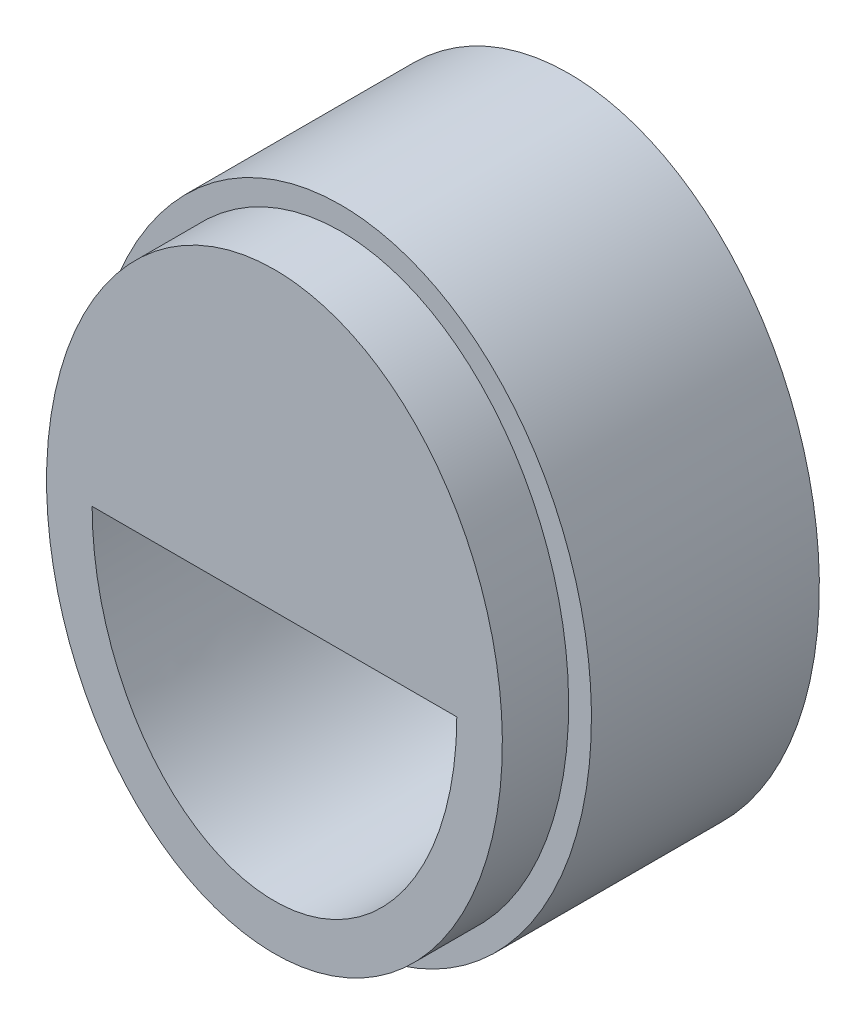
ISO-10303-21;
HEADER;
FILE_DESCRIPTION(('STEP AP214'),'2;1');
FILE_NAME('part.step','',(''),(''),'','','');
FILE_SCHEMA(('AUTOMOTIVE_DESIGN { 1 0 10303 214 1 1 1 1 }'));
ENDSEC;
DATA;
#1=APPLICATION_CONTEXT('core data for automotive mechanical design processes');
#2=APPLICATION_PROTOCOL_DEFINITION('international standard','automotive_design',2000,#1);
#3=PRODUCT_CONTEXT('',#1,'mechanical');
#4=PRODUCT('Part','Part','',(#3));
#5=PRODUCT_RELATED_PRODUCT_CATEGORY('part','',(#4));
#6=PRODUCT_DEFINITION_FORMATION('','',#4);
#7=PRODUCT_DEFINITION_CONTEXT('part definition',#1,'design');
#8=PRODUCT_DEFINITION('design','',#6,#7);
#9=PRODUCT_DEFINITION_SHAPE('','',#8);
#10=(LENGTH_UNIT() NAMED_UNIT(*) SI_UNIT(.MILLI.,.METRE.));
#11=(NAMED_UNIT(*) PLANE_ANGLE_UNIT() SI_UNIT($,.RADIAN.));
#12=(NAMED_UNIT(*) SI_UNIT($,.STERADIAN.) SOLID_ANGLE_UNIT());
#13=UNCERTAINTY_MEASURE_WITH_UNIT(LENGTH_MEASURE(1.E-05),#10,'distance_accuracy_value','');
#14=(GEOMETRIC_REPRESENTATION_CONTEXT(3) GLOBAL_UNCERTAINTY_ASSIGNED_CONTEXT((#13)) GLOBAL_UNIT_ASSIGNED_CONTEXT((#10,
#11,#12)) REPRESENTATION_CONTEXT('',''));
#15=CARTESIAN_POINT('',(0.,0.,0.));
#16=DIRECTION('',(0.,0.,1.));
#17=DIRECTION('',(1.,0.,0.));
#18=AXIS2_PLACEMENT_3D('',#15,#16,#17);
#19=CARTESIAN_POINT('',(0.,0.,10.));
#20=DIRECTION('',(0.,0.,1.));
#21=DIRECTION('',(0.,1.,0.));
#22=AXIS2_PLACEMENT_3D('',#19,#20,#21);
#23=ELLIPSE('',#22,12.,9.);
#24=DIRECTION('',(0.,0.,-1.));
#25=VECTOR('',#24,1.);
#26=SURFACE_OF_LINEAR_EXTRUSION('',#23,#25);
#27=CARTESIAN_POINT('',(0.,0.,0.));
#28=DIRECTION('',(0.,0.,1.));
#29=DIRECTION('',(0.,1.,0.));
#30=AXIS2_PLACEMENT_3D('',#27,#28,#29);
#31=ELLIPSE('',#30,12.,9.);
#32=CARTESIAN_POINT('',(0.,12.,0.));
#33=VERTEX_POINT('',#32);
#34=EDGE_CURVE('E120',#33,#33,#31,.T.);
#35=ORIENTED_EDGE('',*,*,#34,.F.);
#36=EDGE_LOOP('',(#35));
#37=FACE_BOUND('',#36,.T.);
#38=CARTESIAN_POINT('',(0.,0.,2.));
#39=DIRECTION('',(0.,0.,1.));
#40=DIRECTION('',(0.,1.,0.));
#41=AXIS2_PLACEMENT_3D('',#38,#39,#40);
#42=ELLIPSE('',#41,12.,9.);
#43=CARTESIAN_POINT('',(0.,12.,2.));
#44=VERTEX_POINT('',#43);
#45=EDGE_CURVE('E98',#44,#44,#42,.T.);
#46=ORIENTED_EDGE('',*,*,#45,.T.);
#47=EDGE_LOOP('',(#46));
#48=FACE_BOUND('',#47,.T.);
#49=ADVANCED_FACE('F44',(#37,#48),#26,.T.);
#50=CARTESIAN_POINT('',(0.,0.,10.));
#51=DIRECTION('',(0.,0.,1.));
#52=DIRECTION('',(1.,0.,0.));
#53=AXIS2_PLACEMENT_3D('',#50,#51,#52);
#54=PLANE('',#53);
#55=CARTESIAN_POINT('',(0.,0.,10.));
#56=DIRECTION('',(0.,0.,1.));
#57=DIRECTION('',(0.,1.,0.));
#58=AXIS2_PLACEMENT_3D('',#55,#56,#57);
#59=ELLIPSE('',#58,13.,10.);
#60=CARTESIAN_POINT('',(0.,13.,10.));
#61=VERTEX_POINT('',#60);
#62=EDGE_CURVE('E13',#61,#61,#59,.T.);
#63=ORIENTED_EDGE('',*,*,#62,.F.);
#64=EDGE_LOOP('',(#63));
#65=FACE_BOUND('',#64,.T.);
#66=CARTESIAN_POINT('',(0.,0.,10.));
#67=DIRECTION('',(0.,0.,1.));
#68=DIRECTION('',(0.,1.,0.));
#69=AXIS2_PLACEMENT_3D('',#66,#67,#68);
#70=ELLIPSE('',#69,14.,11.);
#71=CARTESIAN_POINT('',(0.,14.,10.));
#72=VERTEX_POINT('',#71);
#73=EDGE_CURVE('E53',#72,#72,#70,.T.);
#74=ORIENTED_EDGE('',*,*,#73,.T.);
#75=EDGE_LOOP('',(#74));
#76=FACE_BOUND('',#75,.T.);
#77=ADVANCED_FACE('F116',(#65,#76),#54,.T.);
#78=CARTESIAN_POINT('',(0.,0.,0.));
#79=DIRECTION('',(0.,0.,1.));
#80=DIRECTION('',(1.,0.,0.));
#81=AXIS2_PLACEMENT_3D('',#78,#79,#80);
#82=PLANE('',#81);
#83=CARTESIAN_POINT('',(0.,0.,0.));
#84=DIRECTION('',(0.,0.,1.));
#85=DIRECTION('',(0.,1.,0.));
#86=AXIS2_PLACEMENT_3D('',#83,#84,#85);
#87=ELLIPSE('',#86,14.,11.);
#88=CARTESIAN_POINT('',(0.,14.,0.));
#89=VERTEX_POINT('',#88);
#90=EDGE_CURVE('E122',#89,#89,#87,.T.);
#91=ORIENTED_EDGE('',*,*,#90,.F.);
#92=EDGE_LOOP('',(#91));
#93=FACE_BOUND('',#92,.T.);
#94=ORIENTED_EDGE('',*,*,#34,.T.);
#95=EDGE_LOOP('',(#94));
#96=FACE_BOUND('',#95,.T.);
#97=ADVANCED_FACE('F134',(#93,#96),#82,.F.);
#98=DIRECTION('',(0.,0.,-1.));
#99=VECTOR('',#98,1.);
#100=SURFACE_OF_LINEAR_EXTRUSION('',#70,#99);
#101=ORIENTED_EDGE('',*,*,#73,.F.);
#102=EDGE_LOOP('',(#101));
#103=FACE_BOUND('',#102,.T.);
#104=ORIENTED_EDGE('',*,*,#90,.T.);
#105=EDGE_LOOP('',(#104));
#106=FACE_BOUND('',#105,.T.);
#107=ADVANCED_FACE('F46',(#103,#106),#100,.F.);
#108=CARTESIAN_POINT('',(0.,0.,2.));
#109=DIRECTION('',(0.,0.,1.));
#110=DIRECTION('',(1.,0.,0.));
#111=AXIS2_PLACEMENT_3D('',#108,#109,#110);
#112=PLANE('',#111);
#113=CARTESIAN_POINT('',(0.,0.,2.));
#114=DIRECTION('',(0.,0.,1.));
#115=DIRECTION('',(0.,1.,0.));
#116=AXIS2_PLACEMENT_3D('',#113,#114,#115);
#117=ELLIPSE('',#116,11.,8.);
#118=CARTESIAN_POINT('',(0.,11.,2.));
#119=VERTEX_POINT('',#118);
#120=EDGE_CURVE('E94',#119,#119,#117,.T.);
#121=ORIENTED_EDGE('',*,*,#120,.T.);
#122=EDGE_LOOP('',(#121));
#123=FACE_BOUND('',#122,.T.);
#124=ORIENTED_EDGE('',*,*,#45,.F.);
#125=EDGE_LOOP('',(#124));
#126=FACE_BOUND('',#125,.T.);
#127=ADVANCED_FACE('F107',(#123,#126),#112,.F.);
#128=CARTESIAN_POINT('',(0.,0.,2.));
#129=DIRECTION('',(0.,0.,1.));
#130=DIRECTION('',(0.,1.,0.));
#131=AXIS2_PLACEMENT_3D('',#128,#129,#130);
#132=ELLIPSE('',#131,13.,10.);
#133=DIRECTION('',(0.,0.,1.));
#134=VECTOR('',#133,1.);
#135=SURFACE_OF_LINEAR_EXTRUSION('',#132,#134);
#136=ORIENTED_EDGE('',*,*,#62,.T.);
#137=EDGE_LOOP('',(#136));
#138=FACE_BOUND('',#137,.T.);
#139=CARTESIAN_POINT('',(0.,0.,12.9096604602894));
#140=DIRECTION('',(0.,0.,1.));
#141=DIRECTION('',(0.,1.,0.));
#142=AXIS2_PLACEMENT_3D('',#139,#140,#141);
#143=ELLIPSE('',#142,13.,10.);
#144=CARTESIAN_POINT('',(0.,13.,12.9096604602894));
#145=VERTEX_POINT('',#144);
#146=EDGE_CURVE('E76',#145,#145,#143,.T.);
#147=ORIENTED_EDGE('',*,*,#146,.F.);
#148=EDGE_LOOP('',(#147));
#149=FACE_BOUND('',#148,.T.);
#150=ADVANCED_FACE('F105',(#138,#149),#135,.T.);
#151=DIRECTION('',(0.,0.,1.));
#152=VECTOR('',#151,1.);
#153=SURFACE_OF_LINEAR_EXTRUSION('',#117,#152);
#154=CARTESIAN_POINT('',(0.,0.,12.9096604602894));
#155=DIRECTION('',(0.,0.,1.));
#156=DIRECTION('',(0.,1.,0.));
#157=AXIS2_PLACEMENT_3D('',#154,#155,#156);
#158=ELLIPSE('',#157,11.,8.);
#159=CARTESIAN_POINT('',(-8.,0.,12.9096604602894));
#160=VERTEX_POINT('',#159);
#161=CARTESIAN_POINT('',(8.,0.,12.9096604602894));
#162=VERTEX_POINT('',#161);
#163=EDGE_CURVE('E72',#160,#162,#158,.T.);
#164=ORIENTED_EDGE('',*,*,#163,.T.);
#165=DIRECTION('',(0.,0.,1.));
#166=VECTOR('',#165,1.);
#167=CARTESIAN_POINT('',(8.,0.,10.9096604602894));
#168=LINE('',#167,#166);
#169=CARTESIAN_POINT('',(8.,0.,10.9096604602894));
#170=VERTEX_POINT('',#169);
#171=EDGE_CURVE('E60',#170,#162,#168,.T.);
#172=ORIENTED_EDGE('',*,*,#171,.F.);
#173=CARTESIAN_POINT('',(0.,0.,10.9096604602894));
#174=DIRECTION('',(0.,0.,1.));
#175=DIRECTION('',(0.,1.,0.));
#176=AXIS2_PLACEMENT_3D('',#173,#174,#175);
#177=ELLIPSE('',#176,11.,8.);
#178=CARTESIAN_POINT('',(-8.,0.,10.9096604602894));
#179=VERTEX_POINT('',#178);
#180=EDGE_CURVE('E64',#170,#179,#177,.T.);
#181=ORIENTED_EDGE('',*,*,#180,.T.);
#182=DIRECTION('',(0.,0.,1.));
#183=VECTOR('',#182,1.);
#184=CARTESIAN_POINT('',(-8.,0.,10.9096604602894));
#185=LINE('',#184,#183);
#186=EDGE_CURVE('E78',#179,#160,#185,.T.);
#187=ORIENTED_EDGE('',*,*,#186,.T.);
#188=EDGE_LOOP('',(#164,#172,#181,#187));
#189=FACE_BOUND('',#188,.T.);
#190=ORIENTED_EDGE('',*,*,#120,.F.);
#191=EDGE_LOOP('',(#190));
#192=FACE_BOUND('',#191,.T.);
#193=ADVANCED_FACE('F79',(#189,#192),#153,.F.);
#194=CARTESIAN_POINT('',(0.,0.,12.9096604602894));
#195=DIRECTION('',(0.,0.,1.));
#196=DIRECTION('',(1.,0.,0.));
#197=AXIS2_PLACEMENT_3D('',#194,#195,#196);
#198=PLANE('',#197);
#199=ORIENTED_EDGE('',*,*,#146,.T.);
#200=EDGE_LOOP('',(#199));
#201=FACE_BOUND('',#200,.T.);
#202=ORIENTED_EDGE('',*,*,#163,.F.);
#203=DIRECTION('',(1.,0.,0.));
#204=VECTOR('',#203,1.);
#205=CARTESIAN_POINT('',(-8.,0.,12.9096604602894));
#206=LINE('',#205,#204);
#207=EDGE_CURVE('E75',#160,#162,#206,.T.);
#208=ORIENTED_EDGE('',*,*,#207,.T.);
#209=EDGE_LOOP('',(#202,#208));
#210=FACE_BOUND('',#209,.T.);
#211=ADVANCED_FACE('F73',(#201,#210),#198,.T.);
#212=CARTESIAN_POINT('',(-8.,0.,10.9096604602894));
#213=DIRECTION('',(0.,-1.,0.));
#214=DIRECTION('',(0.,0.,-1.));
#215=AXIS2_PLACEMENT_3D('',#212,#213,#214);
#216=PLANE('',#215);
#217=ORIENTED_EDGE('',*,*,#207,.F.);
#218=ORIENTED_EDGE('',*,*,#186,.F.);
#219=DIRECTION('',(1.,0.,0.));
#220=VECTOR('',#219,1.);
#221=CARTESIAN_POINT('',(-8.,0.,10.9096604602894));
#222=LINE('',#221,#220);
#223=EDGE_CURVE('E84',#179,#170,#222,.T.);
#224=ORIENTED_EDGE('',*,*,#223,.T.);
#225=ORIENTED_EDGE('',*,*,#171,.T.);
#226=EDGE_LOOP('',(#217,#218,#224,#225));
#227=FACE_BOUND('',#226,.T.);
#228=ADVANCED_FACE('F86',(#227),#216,.T.);
#229=CARTESIAN_POINT('',(0.,0.,10.9096604602894));
#230=DIRECTION('',(0.,0.,1.));
#231=DIRECTION('',(1.,0.,0.));
#232=AXIS2_PLACEMENT_3D('',#229,#230,#231);
#233=PLANE('',#232);
#234=ORIENTED_EDGE('',*,*,#180,.F.);
#235=ORIENTED_EDGE('',*,*,#223,.F.);
#236=EDGE_LOOP('',(#234,#235));
#237=FACE_BOUND('',#236,.T.);
#238=ADVANCED_FACE('F156',(#237),#233,.F.);
#239=CLOSED_SHELL('',(#49,#77,#97,#107,#127,#150,#193,#211,#228,#238));
#240=MANIFOLD_SOLID_BREP('B2',#239);
#241=ADVANCED_BREP_SHAPE_REPRESENTATION('',(#18,#240),#14);
#242=SHAPE_DEFINITION_REPRESENTATION(#9,#241);
ENDSEC;
END-ISO-10303-21;
